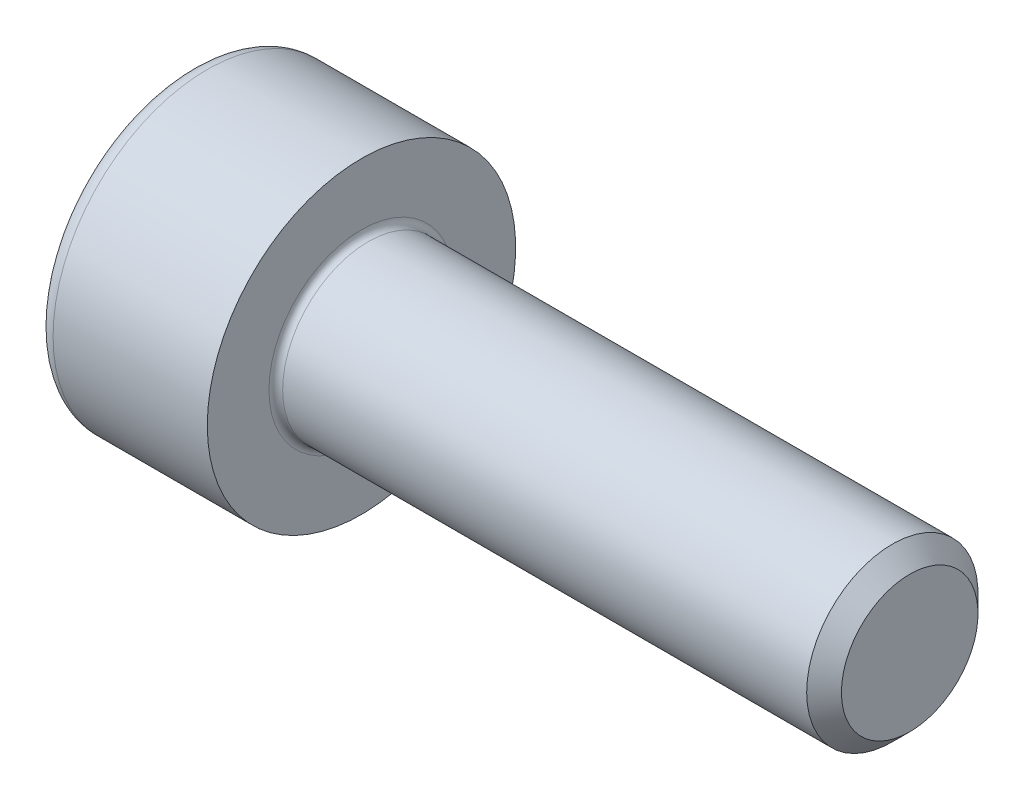
ISO-10303-21;
HEADER;
FILE_DESCRIPTION(('STEP AP214'),'2;1');
FILE_NAME('part.step','',(''),(''),'','','');
FILE_SCHEMA(('AUTOMOTIVE_DESIGN { 1 0 10303 214 1 1 1 1 }'));
ENDSEC;
DATA;
#1=APPLICATION_CONTEXT('core data for automotive mechanical design processes');
#2=APPLICATION_PROTOCOL_DEFINITION('international standard','automotive_design',2000,#1);
#3=PRODUCT_CONTEXT('',#1,'mechanical');
#4=PRODUCT('Part','Part','',(#3));
#5=PRODUCT_RELATED_PRODUCT_CATEGORY('part','',(#4));
#6=PRODUCT_DEFINITION_FORMATION('','',#4);
#7=PRODUCT_DEFINITION_CONTEXT('part definition',#1,'design');
#8=PRODUCT_DEFINITION('design','',#6,#7);
#9=PRODUCT_DEFINITION_SHAPE('','',#8);
#10=(LENGTH_UNIT() NAMED_UNIT(*) SI_UNIT(.MILLI.,.METRE.));
#11=(NAMED_UNIT(*) PLANE_ANGLE_UNIT() SI_UNIT($,.RADIAN.));
#12=(NAMED_UNIT(*) SI_UNIT($,.STERADIAN.) SOLID_ANGLE_UNIT());
#13=UNCERTAINTY_MEASURE_WITH_UNIT(LENGTH_MEASURE(1.E-05),#10,'distance_accuracy_value','');
#14=(GEOMETRIC_REPRESENTATION_CONTEXT(3) GLOBAL_UNCERTAINTY_ASSIGNED_CONTEXT((#13)) GLOBAL_UNIT_ASSIGNED_CONTEXT((#10,
#11,#12)) REPRESENTATION_CONTEXT('',''));
#15=CARTESIAN_POINT('',(0.,0.,0.));
#16=DIRECTION('',(0.,0.,1.));
#17=DIRECTION('',(1.,0.,0.));
#18=AXIS2_PLACEMENT_3D('',#15,#16,#17);
#19=CARTESIAN_POINT('',(0.,0.,0.));
#20=DIRECTION('',(-1.,0.,0.));
#21=DIRECTION('',(0.,0.,1.));
#22=AXIS2_PLACEMENT_3D('',#19,#20,#21);
#23=PLANE('',#22);
#24=DIRECTION('',(0.,-0.499999999999999,0.866025403784439));
#25=VECTOR('',#24,1.);
#26=CARTESIAN_POINT('',(0.,1.16624754376304,0.));
#27=LINE('',#26,#25);
#28=CARTESIAN_POINT('',(0.,1.16624754376304,0.));
#29=VERTEX_POINT('',#28);
#30=CARTESIAN_POINT('',(0.,0.583123771881518,1.01));
#31=VERTEX_POINT('',#30);
#32=EDGE_CURVE('E261',#29,#31,#27,.T.);
#33=ORIENTED_EDGE('',*,*,#32,.T.);
#34=DIRECTION('',(0.,1.,0.));
#35=VECTOR('',#34,1.);
#36=CARTESIAN_POINT('',(0.,-0.583123771881526,1.01));
#37=LINE('',#36,#35);
#38=CARTESIAN_POINT('',(0.,-0.583123771881526,1.01));
#39=VERTEX_POINT('',#38);
#40=EDGE_CURVE('E133',#39,#31,#37,.T.);
#41=ORIENTED_EDGE('',*,*,#40,.F.);
#42=DIRECTION('',(0.,-0.500000000000001,-0.866025403784438));
#43=VECTOR('',#42,1.);
#44=CARTESIAN_POINT('',(0.,-0.583123771881526,1.01));
#45=LINE('',#44,#43);
#46=CARTESIAN_POINT('',(0.,-1.16624754376305,0.));
#47=VERTEX_POINT('',#46);
#48=EDGE_CURVE('E264',#39,#47,#45,.T.);
#49=ORIENTED_EDGE('',*,*,#48,.T.);
#50=DIRECTION('',(0.,0.499999999999999,-0.866025403784439));
#51=VECTOR('',#50,1.);
#52=CARTESIAN_POINT('',(0.,-1.16624754376305,0.));
#53=LINE('',#52,#51);
#54=CARTESIAN_POINT('',(0.,-0.583123771881529,-1.01));
#55=VERTEX_POINT('',#54);
#56=EDGE_CURVE('E267',#47,#55,#53,.T.);
#57=ORIENTED_EDGE('',*,*,#56,.T.);
#58=DIRECTION('',(0.,-1.,0.));
#59=VECTOR('',#58,1.);
#60=CARTESIAN_POINT('',(0.,0.583123771881516,-1.01));
#61=LINE('',#60,#59);
#62=CARTESIAN_POINT('',(0.,0.583123771881516,-1.01));
#63=VERTEX_POINT('',#62);
#64=EDGE_CURVE('E270',#63,#55,#61,.T.);
#65=ORIENTED_EDGE('',*,*,#64,.F.);
#66=DIRECTION('',(0.,-0.500000000000001,-0.866025403784438));
#67=VECTOR('',#66,1.);
#68=CARTESIAN_POINT('',(0.,1.16624754376304,0.));
#69=LINE('',#68,#67);
#70=EDGE_CURVE('E128',#29,#63,#69,.T.);
#71=ORIENTED_EDGE('',*,*,#70,.F.);
#72=EDGE_LOOP('',(#33,#41,#49,#57,#65,#71));
#73=FACE_BOUND('',#72,.T.);
#74=CARTESIAN_POINT('',(0.,0.,0.));
#75=DIRECTION('',(-1.,0.,0.));
#76=DIRECTION('',(0.,0.,1.));
#77=AXIS2_PLACEMENT_3D('',#74,#75,#76);
#78=CIRCLE('',#77,2.);
#79=CARTESIAN_POINT('',(0.,0.,2.));
#80=VERTEX_POINT('',#79);
#81=EDGE_CURVE('E45',#80,#80,#78,.T.);
#82=ORIENTED_EDGE('',*,*,#81,.T.);
#83=EDGE_LOOP('',(#82));
#84=FACE_BOUND('',#83,.T.);
#85=ADVANCED_FACE('F37',(#73,#84),#23,.T.);
#86=CARTESIAN_POINT('',(-31.75,0.,0.));
#87=DIRECTION('',(-1.,0.,0.));
#88=DIRECTION('',(0.,0.,1.));
#89=AXIS2_PLACEMENT_3D('',#86,#87,#88);
#90=CYLINDRICAL_SURFACE('',#89,2.25);
#91=CARTESIAN_POINT('',(0.25,0.,0.));
#92=DIRECTION('',(-1.,0.,0.));
#93=DIRECTION('',(0.,0.,1.));
#94=AXIS2_PLACEMENT_3D('',#91,#92,#93);
#95=CIRCLE('',#94,2.25);
#96=CARTESIAN_POINT('',(0.25,0.,2.25));
#97=VERTEX_POINT('',#96);
#98=EDGE_CURVE('E11',#97,#97,#95,.F.);
#99=ORIENTED_EDGE('',*,*,#98,.T.);
#100=EDGE_LOOP('',(#99));
#101=FACE_BOUND('',#100,.T.);
#102=CARTESIAN_POINT('',(2.5,0.,0.));
#103=DIRECTION('',(-1.,0.,0.));
#104=DIRECTION('',(0.,0.,1.));
#105=AXIS2_PLACEMENT_3D('',#102,#103,#104);
#106=CIRCLE('',#105,2.25);
#107=CARTESIAN_POINT('',(2.5,0.,2.25));
#108=VERTEX_POINT('',#107);
#109=EDGE_CURVE('E151',#108,#108,#106,.T.);
#110=ORIENTED_EDGE('',*,*,#109,.T.);
#111=EDGE_LOOP('',(#110));
#112=FACE_BOUND('',#111,.T.);
#113=ADVANCED_FACE('F175',(#101,#112),#90,.T.);
#114=CARTESIAN_POINT('',(2.5,2.25,0.));
#115=DIRECTION('',(1.,0.,0.));
#116=DIRECTION('',(0.,0.,-1.));
#117=AXIS2_PLACEMENT_3D('',#114,#115,#116);
#118=PLANE('',#117);
#119=CARTESIAN_POINT('',(2.5,0.,0.));
#120=DIRECTION('',(1.,0.,0.));
#121=DIRECTION('',(0.,0.,-1.));
#122=AXIS2_PLACEMENT_3D('',#119,#120,#121);
#123=CIRCLE('',#122,1.35);
#124=CARTESIAN_POINT('',(2.5,0.,-1.35));
#125=VERTEX_POINT('',#124);
#126=EDGE_CURVE('E154',#125,#125,#123,.F.);
#127=ORIENTED_EDGE('',*,*,#126,.T.);
#128=EDGE_LOOP('',(#127));
#129=FACE_BOUND('',#128,.T.);
#130=ORIENTED_EDGE('',*,*,#109,.F.);
#131=EDGE_LOOP('',(#130));
#132=FACE_BOUND('',#131,.T.);
#133=ADVANCED_FACE('F181',(#129,#132),#118,.T.);
#134=CARTESIAN_POINT('',(-31.75,0.,0.));
#135=DIRECTION('',(-1.,0.,0.));
#136=DIRECTION('',(0.,0.,1.));
#137=AXIS2_PLACEMENT_3D('',#134,#135,#136);
#138=CYLINDRICAL_SURFACE('',#137,1.25);
#139=CARTESIAN_POINT('',(2.6,0.,0.));
#140=DIRECTION('',(1.,0.,0.));
#141=DIRECTION('',(0.,0.,-1.));
#142=AXIS2_PLACEMENT_3D('',#139,#140,#141);
#143=CIRCLE('',#142,1.25);
#144=CARTESIAN_POINT('',(2.6,0.,-1.25));
#145=VERTEX_POINT('',#144);
#146=EDGE_CURVE('E157',#145,#145,#143,.T.);
#147=ORIENTED_EDGE('',*,*,#146,.T.);
#148=EDGE_LOOP('',(#147));
#149=FACE_BOUND('',#148,.T.);
#150=CARTESIAN_POINT('',(10.2465,0.,0.));
#151=DIRECTION('',(-1.,0.,0.));
#152=DIRECTION('',(0.,0.,1.));
#153=AXIS2_PLACEMENT_3D('',#150,#151,#152);
#154=CIRCLE('',#153,1.25);
#155=CARTESIAN_POINT('',(10.2465,0.,1.25));
#156=VERTEX_POINT('',#155);
#157=EDGE_CURVE('E148',#156,#156,#154,.T.);
#158=ORIENTED_EDGE('',*,*,#157,.T.);
#159=EDGE_LOOP('',(#158));
#160=FACE_BOUND('',#159,.T.);
#161=ADVANCED_FACE('F187',(#149,#160),#138,.T.);
#162=CARTESIAN_POINT('',(10.5,0.,0.));
#163=DIRECTION('',(-1.,0.,0.));
#164=DIRECTION('',(0.,0.,1.));
#165=AXIS2_PLACEMENT_3D('',#162,#163,#164);
#166=CONICAL_SURFACE('',#165,0.9965,0.785398163397433);
#167=ORIENTED_EDGE('',*,*,#157,.F.);
#168=EDGE_LOOP('',(#167));
#169=FACE_BOUND('',#168,.T.);
#170=CARTESIAN_POINT('',(10.5,0.,0.));
#171=DIRECTION('',(-1.,0.,0.));
#172=DIRECTION('',(0.,0.,1.));
#173=AXIS2_PLACEMENT_3D('',#170,#171,#172);
#174=CIRCLE('',#173,0.9965);
#175=CARTESIAN_POINT('',(10.5,0.,0.9965));
#176=VERTEX_POINT('',#175);
#177=EDGE_CURVE('E144',#176,#176,#174,.T.);
#178=ORIENTED_EDGE('',*,*,#177,.T.);
#179=EDGE_LOOP('',(#178));
#180=FACE_BOUND('',#179,.T.);
#181=ADVANCED_FACE('F191',(#169,#180),#166,.T.);
#182=CARTESIAN_POINT('',(10.5,0.9965,0.));
#183=DIRECTION('',(1.,0.,0.));
#184=DIRECTION('',(0.,0.,-1.));
#185=AXIS2_PLACEMENT_3D('',#182,#183,#184);
#186=PLANE('',#185);
#187=ORIENTED_EDGE('',*,*,#177,.F.);
#188=EDGE_LOOP('',(#187));
#189=FACE_BOUND('',#188,.T.);
#190=ADVANCED_FACE('F171',(#189),#186,.T.);
#191=CARTESIAN_POINT('',(2.6,0.,0.));
#192=DIRECTION('',(1.,0.,0.));
#193=DIRECTION('',(0.,0.,-1.));
#194=AXIS2_PLACEMENT_3D('',#191,#192,#193);
#195=TOROIDAL_SURFACE('',#194,1.35,0.1);
#196=ORIENTED_EDGE('',*,*,#146,.F.);
#197=EDGE_LOOP('',(#196));
#198=FACE_BOUND('',#197,.T.);
#199=ORIENTED_EDGE('',*,*,#126,.F.);
#200=EDGE_LOOP('',(#199));
#201=FACE_BOUND('',#200,.T.);
#202=ADVANCED_FACE('F164',(#198,#201),#195,.F.);
#203=CARTESIAN_POINT('',(0.25,0.,0.));
#204=DIRECTION('',(-1.,0.,0.));
#205=DIRECTION('',(0.,0.,1.));
#206=AXIS2_PLACEMENT_3D('',#203,#204,#205);
#207=TOROIDAL_SURFACE('',#206,2.,0.25);
#208=ORIENTED_EDGE('',*,*,#98,.F.);
#209=EDGE_LOOP('',(#208));
#210=FACE_BOUND('',#209,.T.);
#211=ORIENTED_EDGE('',*,*,#81,.F.);
#212=EDGE_LOOP('',(#211));
#213=FACE_BOUND('',#212,.T.);
#214=ADVANCED_FACE('F39',(#210,#213),#207,.T.);
#215=CARTESIAN_POINT('',(1.1,1.16624754376304,0.));
#216=DIRECTION('',(0.,-0.866025403784439,-0.499999999999999));
#217=DIRECTION('',(0.,0.499999999999999,-0.866025403784439));
#218=AXIS2_PLACEMENT_3D('',#215,#216,#217);
#219=PLANE('',#218);
#220=ORIENTED_EDGE('',*,*,#32,.F.);
#221=DIRECTION('',(-1.,0.,0.));
#222=VECTOR('',#221,1.);
#223=CARTESIAN_POINT('',(1.1,1.16624754376304,0.));
#224=LINE('',#223,#222);
#225=CARTESIAN_POINT('',(1.1,1.16624754376304,0.));
#226=VERTEX_POINT('',#225);
#227=EDGE_CURVE('E251',#226,#29,#224,.T.);
#228=ORIENTED_EDGE('',*,*,#227,.F.);
#229=DIRECTION('',(0.,-0.499999999999999,0.866025403784439));
#230=VECTOR('',#229,1.);
#231=CARTESIAN_POINT('',(1.1,1.16624754376304,0.));
#232=LINE('',#231,#230);
#233=CARTESIAN_POINT('',(1.1,0.874685657822279,0.504999999999997));
#234=VERTEX_POINT('',#233);
#235=EDGE_CURVE('E120',#226,#234,#232,.T.);
#236=ORIENTED_EDGE('',*,*,#235,.T.);
#237=CARTESIAN_POINT('',(1.1,0.583123771881518,1.01));
#238=VERTEX_POINT('',#237);
#239=EDGE_CURVE('E111',#234,#238,#232,.T.);
#240=ORIENTED_EDGE('',*,*,#239,.T.);
#241=DIRECTION('',(-1.,0.,0.));
#242=VECTOR('',#241,1.);
#243=CARTESIAN_POINT('',(1.1,0.583123771881518,1.01));
#244=LINE('',#243,#242);
#245=EDGE_CURVE('E125',#238,#31,#244,.T.);
#246=ORIENTED_EDGE('',*,*,#245,.T.);
#247=EDGE_LOOP('',(#220,#228,#236,#240,#246));
#248=FACE_BOUND('',#247,.T.);
#249=ADVANCED_FACE('F124',(#248),#219,.T.);
#250=CARTESIAN_POINT('',(1.1,-0.583123771881526,1.01));
#251=DIRECTION('',(0.,0.,1.));
#252=DIRECTION('',(0.,-1.,0.));
#253=AXIS2_PLACEMENT_3D('',#250,#251,#252);
#254=PLANE('',#253);
#255=ORIENTED_EDGE('',*,*,#40,.T.);
#256=ORIENTED_EDGE('',*,*,#245,.F.);
#257=DIRECTION('',(0.,1.,0.));
#258=VECTOR('',#257,1.);
#259=CARTESIAN_POINT('',(1.1,-0.583123771881526,1.01));
#260=LINE('',#259,#258);
#261=CARTESIAN_POINT('',(1.1,0.,1.01));
#262=VERTEX_POINT('',#261);
#263=EDGE_CURVE('E108',#262,#238,#260,.T.);
#264=ORIENTED_EDGE('',*,*,#263,.F.);
#265=CARTESIAN_POINT('',(1.1,-0.583123771881526,1.01));
#266=VERTEX_POINT('',#265);
#267=EDGE_CURVE('E119',#266,#262,#260,.T.);
#268=ORIENTED_EDGE('',*,*,#267,.F.);
#269=DIRECTION('',(-1.,0.,0.));
#270=VECTOR('',#269,1.);
#271=CARTESIAN_POINT('',(1.1,-0.583123771881526,1.01));
#272=LINE('',#271,#270);
#273=EDGE_CURVE('E135',#266,#39,#272,.T.);
#274=ORIENTED_EDGE('',*,*,#273,.T.);
#275=EDGE_LOOP('',(#255,#256,#264,#268,#274));
#276=FACE_BOUND('',#275,.T.);
#277=ADVANCED_FACE('F130',(#276),#254,.F.);
#278=CARTESIAN_POINT('',(1.1,-0.583123771881526,1.01));
#279=DIRECTION('',(0.,0.866025403784438,-0.500000000000001));
#280=DIRECTION('',(0.,0.500000000000001,0.866025403784438));
#281=AXIS2_PLACEMENT_3D('',#278,#279,#280);
#282=PLANE('',#281);
#283=ORIENTED_EDGE('',*,*,#48,.F.);
#284=ORIENTED_EDGE('',*,*,#273,.F.);
#285=DIRECTION('',(0.,-0.500000000000001,-0.866025403784438));
#286=VECTOR('',#285,1.);
#287=CARTESIAN_POINT('',(1.1,-0.583123771881526,1.01));
#288=LINE('',#287,#286);
#289=CARTESIAN_POINT('',(1.1,-0.874685657822286,0.505000000000003));
#290=VERTEX_POINT('',#289);
#291=EDGE_CURVE('E290',#266,#290,#288,.T.);
#292=ORIENTED_EDGE('',*,*,#291,.T.);
#293=CARTESIAN_POINT('',(1.1,-1.16624754376305,0.));
#294=VERTEX_POINT('',#293);
#295=EDGE_CURVE('E279',#290,#294,#288,.T.);
#296=ORIENTED_EDGE('',*,*,#295,.T.);
#297=DIRECTION('',(-1.,0.,0.));
#298=VECTOR('',#297,1.);
#299=CARTESIAN_POINT('',(1.1,-1.16624754376305,0.));
#300=LINE('',#299,#298);
#301=EDGE_CURVE('E140',#294,#47,#300,.T.);
#302=ORIENTED_EDGE('',*,*,#301,.T.);
#303=EDGE_LOOP('',(#283,#284,#292,#296,#302));
#304=FACE_BOUND('',#303,.T.);
#305=ADVANCED_FACE('F205',(#304),#282,.T.);
#306=CARTESIAN_POINT('',(1.1,-1.16624754376305,0.));
#307=DIRECTION('',(0.,0.866025403784439,0.499999999999999));
#308=DIRECTION('',(0.,-0.499999999999999,0.866025403784439));
#309=AXIS2_PLACEMENT_3D('',#306,#307,#308);
#310=PLANE('',#309);
#311=ORIENTED_EDGE('',*,*,#56,.F.);
#312=ORIENTED_EDGE('',*,*,#301,.F.);
#313=DIRECTION('',(0.,0.499999999999999,-0.866025403784439));
#314=VECTOR('',#313,1.);
#315=CARTESIAN_POINT('',(1.1,-1.16624754376305,0.));
#316=LINE('',#315,#314);
#317=CARTESIAN_POINT('',(1.1,-0.874685657822289,-0.505000000000002));
#318=VERTEX_POINT('',#317);
#319=EDGE_CURVE('E257',#294,#318,#316,.T.);
#320=ORIENTED_EDGE('',*,*,#319,.T.);
#321=CARTESIAN_POINT('',(1.1,-0.583123771881529,-1.01));
#322=VERTEX_POINT('',#321);
#323=EDGE_CURVE('E289',#318,#322,#316,.T.);
#324=ORIENTED_EDGE('',*,*,#323,.T.);
#325=DIRECTION('',(-1.,0.,0.));
#326=VECTOR('',#325,1.);
#327=CARTESIAN_POINT('',(1.1,-0.583123771881529,-1.01));
#328=LINE('',#327,#326);
#329=EDGE_CURVE('E250',#322,#55,#328,.T.);
#330=ORIENTED_EDGE('',*,*,#329,.T.);
#331=EDGE_LOOP('',(#311,#312,#320,#324,#330));
#332=FACE_BOUND('',#331,.T.);
#333=ADVANCED_FACE('F208',(#332),#310,.T.);
#334=CARTESIAN_POINT('',(1.1,0.583123771881516,-1.01));
#335=DIRECTION('',(0.,0.,-1.));
#336=DIRECTION('',(0.,1.,0.));
#337=AXIS2_PLACEMENT_3D('',#334,#335,#336);
#338=PLANE('',#337);
#339=ORIENTED_EDGE('',*,*,#64,.T.);
#340=ORIENTED_EDGE('',*,*,#329,.F.);
#341=DIRECTION('',(0.,-1.,0.));
#342=VECTOR('',#341,1.);
#343=CARTESIAN_POINT('',(1.1,0.583123771881516,-1.01));
#344=LINE('',#343,#342);
#345=CARTESIAN_POINT('',(1.1,0.,-1.01));
#346=VERTEX_POINT('',#345);
#347=EDGE_CURVE('E254',#346,#322,#344,.T.);
#348=ORIENTED_EDGE('',*,*,#347,.F.);
#349=CARTESIAN_POINT('',(1.1,0.583123771881516,-1.01));
#350=VERTEX_POINT('',#349);
#351=EDGE_CURVE('E52',#350,#346,#344,.T.);
#352=ORIENTED_EDGE('',*,*,#351,.F.);
#353=DIRECTION('',(-1.,0.,0.));
#354=VECTOR('',#353,1.);
#355=CARTESIAN_POINT('',(1.1,0.583123771881516,-1.01));
#356=LINE('',#355,#354);
#357=EDGE_CURVE('E247',#350,#63,#356,.T.);
#358=ORIENTED_EDGE('',*,*,#357,.T.);
#359=EDGE_LOOP('',(#339,#340,#348,#352,#358));
#360=FACE_BOUND('',#359,.T.);
#361=ADVANCED_FACE('F212',(#360),#338,.F.);
#362=CARTESIAN_POINT('',(1.1,1.16624754376304,0.));
#363=DIRECTION('',(0.,0.866025403784438,-0.500000000000001));
#364=DIRECTION('',(0.,0.500000000000002,0.866025403784438));
#365=AXIS2_PLACEMENT_3D('',#362,#363,#364);
#366=PLANE('',#365);
#367=ORIENTED_EDGE('',*,*,#70,.T.);
#368=ORIENTED_EDGE('',*,*,#357,.F.);
#369=DIRECTION('',(0.,-0.500000000000001,-0.866025403784438));
#370=VECTOR('',#369,1.);
#371=CARTESIAN_POINT('',(1.1,1.16624754376304,0.));
#372=LINE('',#371,#370);
#373=CARTESIAN_POINT('',(1.1,0.874685657822279,-0.505));
#374=VERTEX_POINT('',#373);
#375=EDGE_CURVE('E237',#374,#350,#372,.T.);
#376=ORIENTED_EDGE('',*,*,#375,.F.);
#377=EDGE_CURVE('E243',#226,#374,#372,.T.);
#378=ORIENTED_EDGE('',*,*,#377,.F.);
#379=ORIENTED_EDGE('',*,*,#227,.T.);
#380=EDGE_LOOP('',(#367,#368,#376,#378,#379));
#381=FACE_BOUND('',#380,.T.);
#382=ADVANCED_FACE('F216',(#381),#366,.F.);
#383=CARTESIAN_POINT('',(1.1,1.16624754376304,0.));
#384=DIRECTION('',(1.,0.,0.));
#385=DIRECTION('',(0.,0.,-1.));
#386=AXIS2_PLACEMENT_3D('',#383,#384,#385);
#387=PLANE('',#386);
#388=ORIENTED_EDGE('',*,*,#347,.T.);
#389=ORIENTED_EDGE('',*,*,#323,.F.);
#390=CARTESIAN_POINT('',(1.1,0.,0.));
#391=DIRECTION('',(-1.,0.,0.));
#392=DIRECTION('',(0.,0.,1.));
#393=AXIS2_PLACEMENT_3D('',#390,#391,#392);
#394=CIRCLE('',#393,1.01);
#395=EDGE_CURVE('E285',#346,#318,#394,.T.);
#396=ORIENTED_EDGE('',*,*,#395,.F.);
#397=EDGE_LOOP('',(#388,#389,#396));
#398=FACE_BOUND('',#397,.T.);
#399=ADVANCED_FACE('F220',(#398),#387,.F.);
#400=ORIENTED_EDGE('',*,*,#319,.F.);
#401=ORIENTED_EDGE('',*,*,#295,.F.);
#402=EDGE_CURVE('E138',#318,#290,#394,.T.);
#403=ORIENTED_EDGE('',*,*,#402,.F.);
#404=EDGE_LOOP('',(#400,#401,#403));
#405=FACE_BOUND('',#404,.T.);
#406=ADVANCED_FACE('F223',(#405),#387,.F.);
#407=ORIENTED_EDGE('',*,*,#291,.F.);
#408=ORIENTED_EDGE('',*,*,#267,.T.);
#409=EDGE_CURVE('E134',#290,#262,#394,.T.);
#410=ORIENTED_EDGE('',*,*,#409,.F.);
#411=EDGE_LOOP('',(#407,#408,#410));
#412=FACE_BOUND('',#411,.T.);
#413=ADVANCED_FACE('F228',(#412),#387,.F.);
#414=ORIENTED_EDGE('',*,*,#263,.T.);
#415=ORIENTED_EDGE('',*,*,#239,.F.);
#416=EDGE_CURVE('E114',#262,#234,#394,.T.);
#417=ORIENTED_EDGE('',*,*,#416,.F.);
#418=EDGE_LOOP('',(#414,#415,#417));
#419=FACE_BOUND('',#418,.T.);
#420=ADVANCED_FACE('F110',(#419),#387,.F.);
#421=ORIENTED_EDGE('',*,*,#235,.F.);
#422=ORIENTED_EDGE('',*,*,#377,.T.);
#423=EDGE_CURVE('E145',#234,#374,#394,.T.);
#424=ORIENTED_EDGE('',*,*,#423,.F.);
#425=EDGE_LOOP('',(#421,#422,#424));
#426=FACE_BOUND('',#425,.T.);
#427=ADVANCED_FACE('F231',(#426),#387,.F.);
#428=ORIENTED_EDGE('',*,*,#375,.T.);
#429=ORIENTED_EDGE('',*,*,#351,.T.);
#430=EDGE_CURVE('E240',#374,#346,#394,.T.);
#431=ORIENTED_EDGE('',*,*,#430,.F.);
#432=EDGE_LOOP('',(#428,#429,#431));
#433=FACE_BOUND('',#432,.T.);
#434=ADVANCED_FACE('F201',(#433),#387,.F.);
#435=CARTESIAN_POINT('',(1.1,0.,0.));
#436=DIRECTION('',(-1.,0.,0.));
#437=DIRECTION('',(0.,0.,1.));
#438=AXIS2_PLACEMENT_3D('',#435,#436,#437);
#439=CONICAL_SURFACE('',#438,1.01,1.0471975511966);
#440=CARTESIAN_POINT('',(1.68312377188153,0.,0.));
#441=VERTEX_POINT('',#440);
#442=VERTEX_LOOP('',#441);
#443=FACE_BOUND('',#442,.T.);
#444=ORIENTED_EDGE('',*,*,#416,.T.);
#445=ORIENTED_EDGE('',*,*,#423,.T.);
#446=ORIENTED_EDGE('',*,*,#430,.T.);
#447=ORIENTED_EDGE('',*,*,#395,.T.);
#448=ORIENTED_EDGE('',*,*,#402,.T.);
#449=ORIENTED_EDGE('',*,*,#409,.T.);
#450=EDGE_LOOP('',(#444,#445,#446,#447,#448,#449));
#451=FACE_BOUND('',#450,.T.);
#452=ADVANCED_FACE('F199',(#443,#451),#439,.F.);
#453=CLOSED_SHELL('',(#85,#113,#133,#161,#181,#190,#202,#214,#249,#277,#305,#333,#361,#382,#399,
#406,#413,#420,#427,#434,#452));
#454=MANIFOLD_SOLID_BREP('B2',#453);
#455=ADVANCED_BREP_SHAPE_REPRESENTATION('',(#18,#454),#14);
#456=SHAPE_DEFINITION_REPRESENTATION(#9,#455);
ENDSEC;
END-ISO-10303-21;
